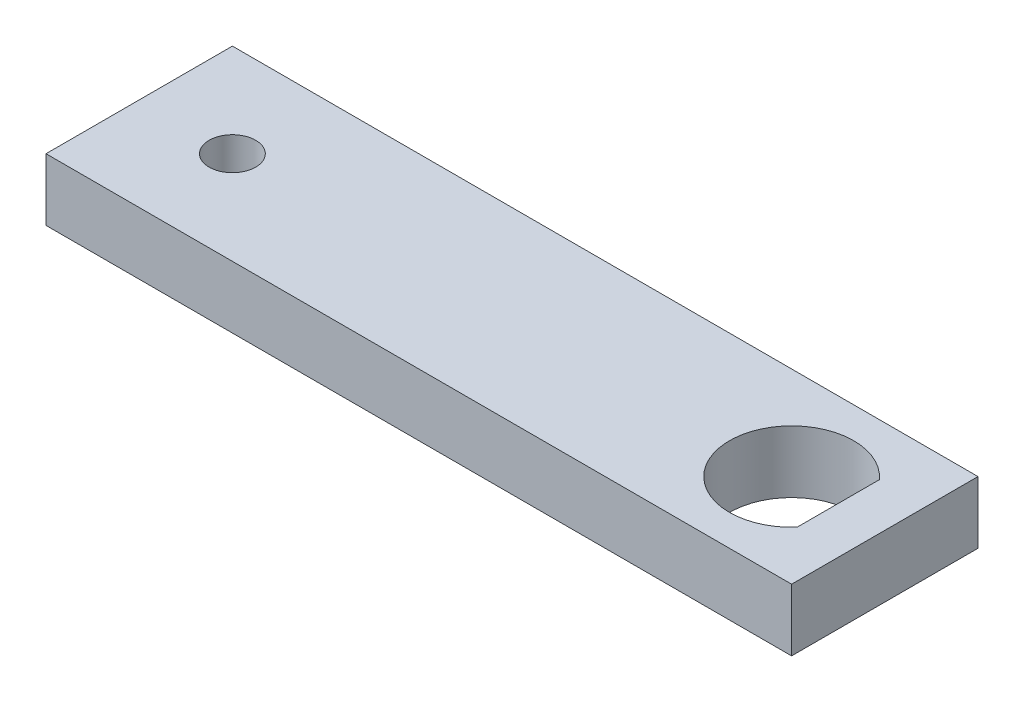
ISO-10303-21;
HEADER;
FILE_DESCRIPTION(('STEP AP214'),'2;1');
FILE_NAME('part.step','',(''),(''),'','','');
FILE_SCHEMA(('AUTOMOTIVE_DESIGN { 1 0 10303 214 1 1 1 1 }'));
ENDSEC;
DATA;
#1=APPLICATION_CONTEXT('core data for automotive mechanical design processes');
#2=APPLICATION_PROTOCOL_DEFINITION('international standard','automotive_design',2000,#1);
#3=PRODUCT_CONTEXT('',#1,'mechanical');
#4=PRODUCT('Part','Part','',(#3));
#5=PRODUCT_RELATED_PRODUCT_CATEGORY('part','',(#4));
#6=PRODUCT_DEFINITION_FORMATION('','',#4);
#7=PRODUCT_DEFINITION_CONTEXT('part definition',#1,'design');
#8=PRODUCT_DEFINITION('design','',#6,#7);
#9=PRODUCT_DEFINITION_SHAPE('','',#8);
#10=(LENGTH_UNIT() NAMED_UNIT(*) SI_UNIT(.MILLI.,.METRE.));
#11=(NAMED_UNIT(*) PLANE_ANGLE_UNIT() SI_UNIT($,.RADIAN.));
#12=(NAMED_UNIT(*) SI_UNIT($,.STERADIAN.) SOLID_ANGLE_UNIT());
#13=UNCERTAINTY_MEASURE_WITH_UNIT(LENGTH_MEASURE(1.E-05),#10,'distance_accuracy_value','');
#14=(GEOMETRIC_REPRESENTATION_CONTEXT(3) GLOBAL_UNCERTAINTY_ASSIGNED_CONTEXT((#13)) GLOBAL_UNIT_ASSIGNED_CONTEXT((#10,
#11,#12)) REPRESENTATION_CONTEXT('',''));
#15=CARTESIAN_POINT('',(0.,0.,0.));
#16=DIRECTION('',(0.,0.,1.));
#17=DIRECTION('',(1.,0.,0.));
#18=AXIS2_PLACEMENT_3D('',#15,#16,#17);
#19=CARTESIAN_POINT('',(0.,0.,19.05));
#20=DIRECTION('',(-1.,0.,0.));
#21=DIRECTION('',(0.,0.,1.));
#22=AXIS2_PLACEMENT_3D('',#19,#20,#21);
#23=PLANE('',#22);
#24=DIRECTION('',(0.,1.,0.));
#25=VECTOR('',#24,1.);
#26=CARTESIAN_POINT('',(0.,0.,0.));
#27=LINE('',#26,#25);
#28=CARTESIAN_POINT('',(0.,0.,0.));
#29=VERTEX_POINT('',#28);
#30=CARTESIAN_POINT('',(0.,6.35000000000002,0.));
#31=VERTEX_POINT('',#30);
#32=EDGE_CURVE('E87',#29,#31,#27,.T.);
#33=ORIENTED_EDGE('',*,*,#32,.F.);
#34=DIRECTION('',(0.,0.,-1.));
#35=VECTOR('',#34,1.);
#36=CARTESIAN_POINT('',(0.,0.,19.05));
#37=LINE('',#36,#35);
#38=CARTESIAN_POINT('',(0.,0.,19.05));
#39=VERTEX_POINT('',#38);
#40=EDGE_CURVE('E11',#39,#29,#37,.T.);
#41=ORIENTED_EDGE('',*,*,#40,.F.);
#42=DIRECTION('',(0.,1.,0.));
#43=VECTOR('',#42,1.);
#44=CARTESIAN_POINT('',(0.,0.,19.05));
#45=LINE('',#44,#43);
#46=CARTESIAN_POINT('',(0.,6.35000000000002,19.05));
#47=VERTEX_POINT('',#46);
#48=EDGE_CURVE('E119',#39,#47,#45,.T.);
#49=ORIENTED_EDGE('',*,*,#48,.T.);
#50=DIRECTION('',(0.,0.,-1.));
#51=VECTOR('',#50,1.);
#52=CARTESIAN_POINT('',(0.,6.35000000000002,19.05));
#53=LINE('',#52,#51);
#54=EDGE_CURVE('E35',#47,#31,#53,.T.);
#55=ORIENTED_EDGE('',*,*,#54,.T.);
#56=EDGE_LOOP('',(#33,#41,#49,#55));
#57=FACE_BOUND('',#56,.T.);
#58=ADVANCED_FACE('F32',(#57),#23,.T.);
#59=CARTESIAN_POINT('',(0.,0.,19.05));
#60=DIRECTION('',(0.,1.,0.));
#61=DIRECTION('',(-1.,0.,0.));
#62=AXIS2_PLACEMENT_3D('',#59,#60,#61);
#63=PLANE('',#62);
#64=CARTESIAN_POINT('',(9.52500000000004,0.,9.52499999999998));
#65=DIRECTION('',(0.,1.,0.));
#66=DIRECTION('',(-1.,0.,0.));
#67=AXIS2_PLACEMENT_3D('',#64,#65,#66);
#68=CIRCLE('',#67,2.38125);
#69=CARTESIAN_POINT('',(7.14375000000004,0.,9.52499999999998));
#70=VERTEX_POINT('',#69);
#71=EDGE_CURVE('E97',#70,#70,#68,.T.);
#72=ORIENTED_EDGE('',*,*,#71,.T.);
#73=EDGE_LOOP('',(#72));
#74=FACE_BOUND('',#73,.T.);
#75=DIRECTION('',(0.,0.,1.));
#76=VECTOR('',#75,1.);
#77=CARTESIAN_POINT('',(71.4375000000001,0.,5.32486979368493));
#78=LINE('',#77,#76);
#79=CARTESIAN_POINT('',(71.4375000000001,0.,5.32486979368493));
#80=VERTEX_POINT('',#79);
#81=CARTESIAN_POINT('',(71.4375000000001,0.,13.7251302063151));
#82=VERTEX_POINT('',#81);
#83=EDGE_CURVE('E105',#80,#82,#78,.T.);
#84=ORIENTED_EDGE('',*,*,#83,.F.);
#85=CARTESIAN_POINT('',(66.675,0.,9.525));
#86=DIRECTION('',(0.,1.,0.));
#87=DIRECTION('',(-1.,0.,0.));
#88=AXIS2_PLACEMENT_3D('',#85,#86,#87);
#89=CIRCLE('',#88,6.35);
#90=EDGE_CURVE('E48',#80,#82,#89,.T.);
#91=ORIENTED_EDGE('',*,*,#90,.T.);
#92=EDGE_LOOP('',(#84,#91));
#93=FACE_BOUND('',#92,.T.);
#94=DIRECTION('',(1.,0.,0.));
#95=VECTOR('',#94,1.);
#96=CARTESIAN_POINT('',(0.,0.,0.));
#97=LINE('',#96,#95);
#98=CARTESIAN_POINT('',(76.2000000000001,0.,0.));
#99=VERTEX_POINT('',#98);
#100=EDGE_CURVE('E116',#29,#99,#97,.T.);
#101=ORIENTED_EDGE('',*,*,#100,.T.);
#102=DIRECTION('',(0.,0.,-1.));
#103=VECTOR('',#102,1.);
#104=CARTESIAN_POINT('',(76.2000000000001,0.,19.05));
#105=LINE('',#104,#103);
#106=CARTESIAN_POINT('',(76.2000000000001,0.,19.05));
#107=VERTEX_POINT('',#106);
#108=EDGE_CURVE('E40',#107,#99,#105,.T.);
#109=ORIENTED_EDGE('',*,*,#108,.F.);
#110=DIRECTION('',(1.,0.,0.));
#111=VECTOR('',#110,1.);
#112=CARTESIAN_POINT('',(0.,0.,19.05));
#113=LINE('',#112,#111);
#114=EDGE_CURVE('E127',#39,#107,#113,.T.);
#115=ORIENTED_EDGE('',*,*,#114,.F.);
#116=ORIENTED_EDGE('',*,*,#40,.T.);
#117=EDGE_LOOP('',(#101,#109,#115,#116));
#118=FACE_BOUND('',#117,.T.);
#119=ADVANCED_FACE('F142',(#74,#93,#118),#63,.F.);
#120=CARTESIAN_POINT('',(76.2000000000001,6.34999999999999,19.05));
#121=DIRECTION('',(1.,0.,0.));
#122=DIRECTION('',(0.,0.,-1.));
#123=AXIS2_PLACEMENT_3D('',#120,#121,#122);
#124=PLANE('',#123);
#125=DIRECTION('',(0.,-1.,0.));
#126=VECTOR('',#125,1.);
#127=CARTESIAN_POINT('',(76.2000000000001,6.34999999999999,0.));
#128=LINE('',#127,#126);
#129=CARTESIAN_POINT('',(76.2000000000001,6.34999999999999,0.));
#130=VERTEX_POINT('',#129);
#131=EDGE_CURVE('E113',#130,#99,#128,.T.);
#132=ORIENTED_EDGE('',*,*,#131,.F.);
#133=DIRECTION('',(0.,0.,-1.));
#134=VECTOR('',#133,1.);
#135=CARTESIAN_POINT('',(76.2000000000001,6.34999999999999,19.05));
#136=LINE('',#135,#134);
#137=CARTESIAN_POINT('',(76.2000000000001,6.34999999999999,19.05));
#138=VERTEX_POINT('',#137);
#139=EDGE_CURVE('E129',#138,#130,#136,.T.);
#140=ORIENTED_EDGE('',*,*,#139,.F.);
#141=DIRECTION('',(0.,-1.,0.));
#142=VECTOR('',#141,1.);
#143=CARTESIAN_POINT('',(76.2000000000001,6.34999999999999,19.05));
#144=LINE('',#143,#142);
#145=EDGE_CURVE('E124',#138,#107,#144,.T.);
#146=ORIENTED_EDGE('',*,*,#145,.T.);
#147=ORIENTED_EDGE('',*,*,#108,.T.);
#148=EDGE_LOOP('',(#132,#140,#146,#147));
#149=FACE_BOUND('',#148,.T.);
#150=ADVANCED_FACE('F148',(#149),#124,.T.);
#151=CARTESIAN_POINT('',(76.2000000000001,6.34999999999999,19.05));
#152=DIRECTION('',(0.,-1.,0.));
#153=DIRECTION('',(1.,0.,0.));
#154=AXIS2_PLACEMENT_3D('',#151,#152,#153);
#155=PLANE('',#154);
#156=CARTESIAN_POINT('',(9.52500000000004,6.35000000000002,9.52499999999998));
#157=DIRECTION('',(0.,1.,0.));
#158=DIRECTION('',(-1.,0.,0.));
#159=AXIS2_PLACEMENT_3D('',#156,#157,#158);
#160=CIRCLE('',#159,2.38125);
#161=CARTESIAN_POINT('',(7.14375000000004,6.35000000000002,9.52499999999998));
#162=VERTEX_POINT('',#161);
#163=EDGE_CURVE('E100',#162,#162,#160,.T.);
#164=ORIENTED_EDGE('',*,*,#163,.F.);
#165=EDGE_LOOP('',(#164));
#166=FACE_BOUND('',#165,.T.);
#167=DIRECTION('',(0.,0.,1.));
#168=VECTOR('',#167,1.);
#169=CARTESIAN_POINT('',(71.4375000000001,6.34999999999999,5.32486979368493));
#170=LINE('',#169,#168);
#171=CARTESIAN_POINT('',(71.4375000000001,6.34999999999999,5.32486979368493));
#172=VERTEX_POINT('',#171);
#173=CARTESIAN_POINT('',(71.4375000000001,6.34999999999999,13.7251302063151));
#174=VERTEX_POINT('',#173);
#175=EDGE_CURVE('E91',#172,#174,#170,.T.);
#176=ORIENTED_EDGE('',*,*,#175,.T.);
#177=CARTESIAN_POINT('',(66.675,6.34999999999999,9.525));
#178=DIRECTION('',(0.,1.,0.));
#179=DIRECTION('',(-1.,0.,0.));
#180=AXIS2_PLACEMENT_3D('',#177,#178,#179);
#181=CIRCLE('',#180,6.35);
#182=EDGE_CURVE('E53',#172,#174,#181,.T.);
#183=ORIENTED_EDGE('',*,*,#182,.F.);
#184=EDGE_LOOP('',(#176,#183));
#185=FACE_BOUND('',#184,.T.);
#186=DIRECTION('',(-1.,0.,0.));
#187=VECTOR('',#186,1.);
#188=CARTESIAN_POINT('',(76.2000000000001,6.34999999999999,0.));
#189=LINE('',#188,#187);
#190=EDGE_CURVE('E110',#130,#31,#189,.T.);
#191=ORIENTED_EDGE('',*,*,#190,.T.);
#192=ORIENTED_EDGE('',*,*,#54,.F.);
#193=DIRECTION('',(-1.,0.,0.));
#194=VECTOR('',#193,1.);
#195=CARTESIAN_POINT('',(76.2000000000001,6.34999999999999,19.05));
#196=LINE('',#195,#194);
#197=EDGE_CURVE('E122',#138,#47,#196,.T.);
#198=ORIENTED_EDGE('',*,*,#197,.F.);
#199=ORIENTED_EDGE('',*,*,#139,.T.);
#200=EDGE_LOOP('',(#191,#192,#198,#199));
#201=FACE_BOUND('',#200,.T.);
#202=ADVANCED_FACE('F95',(#166,#185,#201),#155,.F.);
#203=CARTESIAN_POINT('',(0.,0.,19.05));
#204=DIRECTION('',(0.,0.,-1.));
#205=DIRECTION('',(-1.,0.,0.));
#206=AXIS2_PLACEMENT_3D('',#203,#204,#205);
#207=PLANE('',#206);
#208=ORIENTED_EDGE('',*,*,#48,.F.);
#209=ORIENTED_EDGE('',*,*,#114,.T.);
#210=ORIENTED_EDGE('',*,*,#145,.F.);
#211=ORIENTED_EDGE('',*,*,#197,.T.);
#212=EDGE_LOOP('',(#208,#209,#210,#211));
#213=FACE_BOUND('',#212,.T.);
#214=ADVANCED_FACE('F146',(#213),#207,.F.);
#215=CARTESIAN_POINT('',(0.,0.,0.));
#216=DIRECTION('',(0.,0.,-1.));
#217=DIRECTION('',(-1.,0.,0.));
#218=AXIS2_PLACEMENT_3D('',#215,#216,#217);
#219=PLANE('',#218);
#220=ORIENTED_EDGE('',*,*,#32,.T.);
#221=ORIENTED_EDGE('',*,*,#190,.F.);
#222=ORIENTED_EDGE('',*,*,#131,.T.);
#223=ORIENTED_EDGE('',*,*,#100,.F.);
#224=EDGE_LOOP('',(#220,#221,#222,#223));
#225=FACE_BOUND('',#224,.T.);
#226=ADVANCED_FACE('F139',(#225),#219,.T.);
#227=CARTESIAN_POINT('',(66.675,0.,9.525));
#228=DIRECTION('',(0.,1.,0.));
#229=DIRECTION('',(-1.,0.,0.));
#230=AXIS2_PLACEMENT_3D('',#227,#228,#229);
#231=CYLINDRICAL_SURFACE('',#230,6.35);
#232=ORIENTED_EDGE('',*,*,#182,.T.);
#233=DIRECTION('',(0.,1.,0.));
#234=VECTOR('',#233,1.);
#235=CARTESIAN_POINT('',(71.4375000000001,0.,13.7251302063151));
#236=LINE('',#235,#234);
#237=EDGE_CURVE('E88',#82,#174,#236,.T.);
#238=ORIENTED_EDGE('',*,*,#237,.F.);
#239=ORIENTED_EDGE('',*,*,#90,.F.);
#240=DIRECTION('',(0.,1.,0.));
#241=VECTOR('',#240,1.);
#242=CARTESIAN_POINT('',(71.4375000000001,0.,5.32486979368493));
#243=LINE('',#242,#241);
#244=EDGE_CURVE('E82',#80,#172,#243,.T.);
#245=ORIENTED_EDGE('',*,*,#244,.T.);
#246=EDGE_LOOP('',(#232,#238,#239,#245));
#247=FACE_BOUND('',#246,.T.);
#248=ADVANCED_FACE('F84',(#247),#231,.F.);
#249=CARTESIAN_POINT('',(71.4375000000001,0.,5.32486979368493));
#250=DIRECTION('',(-1.,0.,0.));
#251=DIRECTION('',(0.,-1.,0.));
#252=AXIS2_PLACEMENT_3D('',#249,#250,#251);
#253=PLANE('',#252);
#254=ORIENTED_EDGE('',*,*,#175,.F.);
#255=ORIENTED_EDGE('',*,*,#244,.F.);
#256=ORIENTED_EDGE('',*,*,#83,.T.);
#257=ORIENTED_EDGE('',*,*,#237,.T.);
#258=EDGE_LOOP('',(#254,#255,#256,#257));
#259=FACE_BOUND('',#258,.T.);
#260=ADVANCED_FACE('F92',(#259),#253,.T.);
#261=CARTESIAN_POINT('',(9.52500000000004,0.,9.52499999999998));
#262=DIRECTION('',(0.,1.,0.));
#263=DIRECTION('',(-1.,0.,0.));
#264=AXIS2_PLACEMENT_3D('',#261,#262,#263);
#265=CYLINDRICAL_SURFACE('',#264,2.38125);
#266=ORIENTED_EDGE('',*,*,#71,.F.);
#267=EDGE_LOOP('',(#266));
#268=FACE_BOUND('',#267,.T.);
#269=ORIENTED_EDGE('',*,*,#163,.T.);
#270=EDGE_LOOP('',(#269));
#271=FACE_BOUND('',#270,.T.);
#272=ADVANCED_FACE('F208',(#268,#271),#265,.F.);
#273=CLOSED_SHELL('',(#58,#119,#150,#202,#214,#226,#248,#260,#272));
#274=MANIFOLD_SOLID_BREP('B2',#273);
#275=ADVANCED_BREP_SHAPE_REPRESENTATION('',(#18,#274),#14);
#276=SHAPE_DEFINITION_REPRESENTATION(#9,#275);
ENDSEC;
END-ISO-10303-21;
